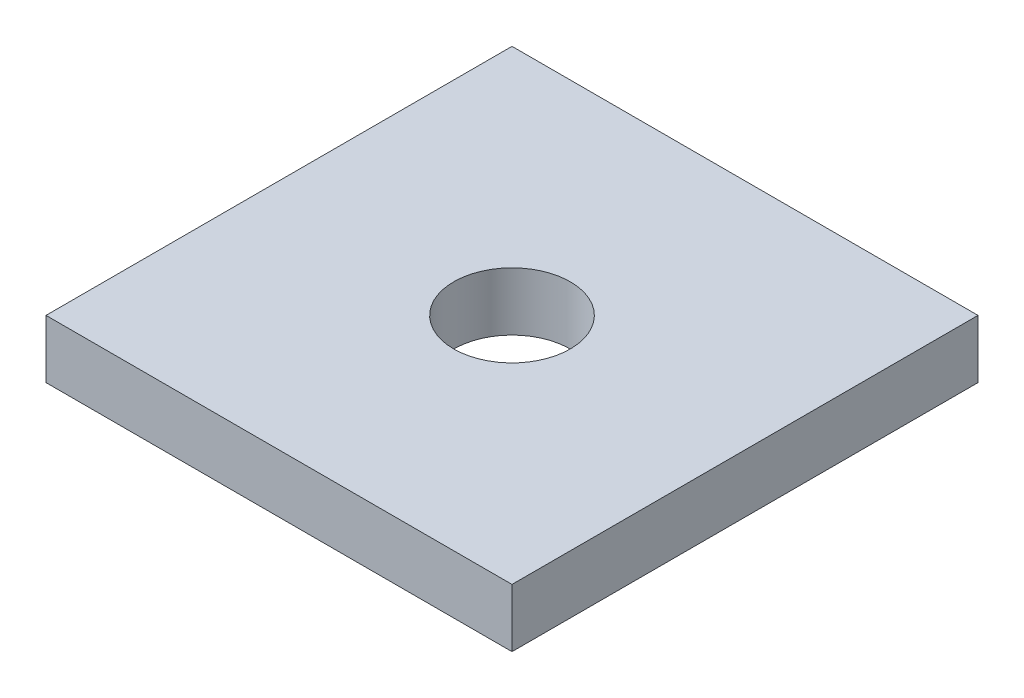
ISO-10303-21;
HEADER;
FILE_DESCRIPTION(('STEP AP214'),'2;1');
FILE_NAME('part.step','',(''),(''),'','','');
FILE_SCHEMA(('AUTOMOTIVE_DESIGN { 1 0 10303 214 1 1 1 1 }'));
ENDSEC;
DATA;
#1=APPLICATION_CONTEXT('core data for automotive mechanical design processes');
#2=APPLICATION_PROTOCOL_DEFINITION('international standard','automotive_design',2000,#1);
#3=PRODUCT_CONTEXT('',#1,'mechanical');
#4=PRODUCT('Part','Part','',(#3));
#5=PRODUCT_RELATED_PRODUCT_CATEGORY('part','',(#4));
#6=PRODUCT_DEFINITION_FORMATION('','',#4);
#7=PRODUCT_DEFINITION_CONTEXT('part definition',#1,'design');
#8=PRODUCT_DEFINITION('design','',#6,#7);
#9=PRODUCT_DEFINITION_SHAPE('','',#8);
#10=(LENGTH_UNIT() NAMED_UNIT(*) SI_UNIT(.MILLI.,.METRE.));
#11=(NAMED_UNIT(*) PLANE_ANGLE_UNIT() SI_UNIT($,.RADIAN.));
#12=(NAMED_UNIT(*) SI_UNIT($,.STERADIAN.) SOLID_ANGLE_UNIT());
#13=UNCERTAINTY_MEASURE_WITH_UNIT(LENGTH_MEASURE(1.E-05),#10,'distance_accuracy_value','');
#14=(GEOMETRIC_REPRESENTATION_CONTEXT(3) GLOBAL_UNCERTAINTY_ASSIGNED_CONTEXT((#13)) GLOBAL_UNIT_ASSIGNED_CONTEXT((#10,
#11,#12)) REPRESENTATION_CONTEXT('',''));
#15=CARTESIAN_POINT('',(0.,0.,0.));
#16=DIRECTION('',(0.,0.,1.));
#17=DIRECTION('',(1.,0.,0.));
#18=AXIS2_PLACEMENT_3D('',#15,#16,#17);
#19=CARTESIAN_POINT('',(0.,9.525,-76.2));
#20=DIRECTION('',(0.,-1.,0.));
#21=DIRECTION('',(0.,0.,-1.));
#22=AXIS2_PLACEMENT_3D('',#19,#20,#21);
#23=PLANE('',#22);
#24=DIRECTION('',(0.,0.,1.));
#25=VECTOR('',#24,1.);
#26=CARTESIAN_POINT('',(0.,9.525,0.));
#27=LINE('',#26,#25);
#28=CARTESIAN_POINT('',(0.,9.525,-76.2));
#29=VERTEX_POINT('',#28);
#30=CARTESIAN_POINT('',(0.,9.525,0.));
#31=VERTEX_POINT('',#30);
#32=EDGE_CURVE('E86',#29,#31,#27,.T.);
#33=ORIENTED_EDGE('',*,*,#32,.T.);
#34=DIRECTION('',(1.,0.,0.));
#35=VECTOR('',#34,1.);
#36=CARTESIAN_POINT('',(0.,9.525,0.));
#37=LINE('',#36,#35);
#38=CARTESIAN_POINT('',(76.2,9.525,0.));
#39=VERTEX_POINT('',#38);
#40=EDGE_CURVE('E81',#31,#39,#37,.T.);
#41=ORIENTED_EDGE('',*,*,#40,.T.);
#42=DIRECTION('',(0.,0.,-1.));
#43=VECTOR('',#42,1.);
#44=CARTESIAN_POINT('',(76.2,9.525,0.));
#45=LINE('',#44,#43);
#46=CARTESIAN_POINT('',(76.2,9.525,-76.2));
#47=VERTEX_POINT('',#46);
#48=EDGE_CURVE('E84',#39,#47,#45,.T.);
#49=ORIENTED_EDGE('',*,*,#48,.T.);
#50=DIRECTION('',(-1.,0.,0.));
#51=VECTOR('',#50,1.);
#52=CARTESIAN_POINT('',(0.,9.525,-76.2));
#53=LINE('',#52,#51);
#54=EDGE_CURVE('E51',#47,#29,#53,.T.);
#55=ORIENTED_EDGE('',*,*,#54,.T.);
#56=EDGE_LOOP('',(#33,#41,#49,#55));
#57=FACE_BOUND('',#56,.T.);
#58=CARTESIAN_POINT('',(38.1,9.525,-38.1));
#59=DIRECTION('',(0.,1.,0.));
#60=DIRECTION('',(0.,0.,1.));
#61=AXIS2_PLACEMENT_3D('',#58,#59,#60);
#62=CIRCLE('',#61,9.525);
#63=CARTESIAN_POINT('',(38.1,9.525,-28.575));
#64=VERTEX_POINT('',#63);
#65=EDGE_CURVE('E101',#64,#64,#62,.T.);
#66=ORIENTED_EDGE('',*,*,#65,.F.);
#67=EDGE_LOOP('',(#66));
#68=FACE_BOUND('',#67,.T.);
#69=ADVANCED_FACE('F34',(#57,#68),#23,.F.);
#70=CARTESIAN_POINT('',(0.,0.,-76.2));
#71=DIRECTION('',(0.,-1.,0.));
#72=DIRECTION('',(0.,0.,-1.));
#73=AXIS2_PLACEMENT_3D('',#70,#71,#72);
#74=PLANE('',#73);
#75=DIRECTION('',(0.,0.,1.));
#76=VECTOR('',#75,1.);
#77=CARTESIAN_POINT('',(0.,0.,0.));
#78=LINE('',#77,#76);
#79=CARTESIAN_POINT('',(0.,0.,-76.2));
#80=VERTEX_POINT('',#79);
#81=CARTESIAN_POINT('',(0.,0.,0.));
#82=VERTEX_POINT('',#81);
#83=EDGE_CURVE('E98',#80,#82,#78,.T.);
#84=ORIENTED_EDGE('',*,*,#83,.F.);
#85=DIRECTION('',(-1.,0.,0.));
#86=VECTOR('',#85,1.);
#87=CARTESIAN_POINT('',(0.,0.,-76.2));
#88=LINE('',#87,#86);
#89=CARTESIAN_POINT('',(76.2,0.,-76.2));
#90=VERTEX_POINT('',#89);
#91=EDGE_CURVE('E74',#90,#80,#88,.T.);
#92=ORIENTED_EDGE('',*,*,#91,.F.);
#93=DIRECTION('',(0.,0.,-1.));
#94=VECTOR('',#93,1.);
#95=CARTESIAN_POINT('',(76.2,0.,0.));
#96=LINE('',#95,#94);
#97=CARTESIAN_POINT('',(76.2,0.,0.));
#98=VERTEX_POINT('',#97);
#99=EDGE_CURVE('E68',#98,#90,#96,.T.);
#100=ORIENTED_EDGE('',*,*,#99,.F.);
#101=DIRECTION('',(1.,0.,0.));
#102=VECTOR('',#101,1.);
#103=CARTESIAN_POINT('',(0.,0.,0.));
#104=LINE('',#103,#102);
#105=EDGE_CURVE('E90',#82,#98,#104,.T.);
#106=ORIENTED_EDGE('',*,*,#105,.F.);
#107=EDGE_LOOP('',(#84,#92,#100,#106));
#108=FACE_BOUND('',#107,.T.);
#109=CARTESIAN_POINT('',(38.1,0.,-38.1));
#110=DIRECTION('',(0.,1.,0.));
#111=DIRECTION('',(0.,0.,1.));
#112=AXIS2_PLACEMENT_3D('',#109,#110,#111);
#113=CIRCLE('',#112,9.525);
#114=CARTESIAN_POINT('',(38.1,0.,-28.575));
#115=VERTEX_POINT('',#114);
#116=EDGE_CURVE('E113',#115,#115,#113,.T.);
#117=ORIENTED_EDGE('',*,*,#116,.T.);
#118=EDGE_LOOP('',(#117));
#119=FACE_BOUND('',#118,.T.);
#120=ADVANCED_FACE('F109',(#108,#119),#74,.T.);
#121=CARTESIAN_POINT('',(0.,9.525,0.));
#122=DIRECTION('',(1.,0.,0.));
#123=DIRECTION('',(0.,0.,-1.));
#124=AXIS2_PLACEMENT_3D('',#121,#122,#123);
#125=PLANE('',#124);
#126=ORIENTED_EDGE('',*,*,#83,.T.);
#127=DIRECTION('',(0.,-1.,0.));
#128=VECTOR('',#127,1.);
#129=CARTESIAN_POINT('',(0.,9.525,0.));
#130=LINE('',#129,#128);
#131=EDGE_CURVE('E11',#31,#82,#130,.T.);
#132=ORIENTED_EDGE('',*,*,#131,.F.);
#133=ORIENTED_EDGE('',*,*,#32,.F.);
#134=DIRECTION('',(0.,-1.,0.));
#135=VECTOR('',#134,1.);
#136=CARTESIAN_POINT('',(0.,9.525,-76.2));
#137=LINE('',#136,#135);
#138=EDGE_CURVE('E94',#29,#80,#137,.T.);
#139=ORIENTED_EDGE('',*,*,#138,.T.);
#140=EDGE_LOOP('',(#126,#132,#133,#139));
#141=FACE_BOUND('',#140,.T.);
#142=ADVANCED_FACE('F36',(#141),#125,.F.);
#143=CARTESIAN_POINT('',(0.,9.525,0.));
#144=DIRECTION('',(0.,0.,-1.));
#145=DIRECTION('',(-1.,0.,0.));
#146=AXIS2_PLACEMENT_3D('',#143,#144,#145);
#147=PLANE('',#146);
#148=ORIENTED_EDGE('',*,*,#105,.T.);
#149=DIRECTION('',(0.,-1.,0.));
#150=VECTOR('',#149,1.);
#151=CARTESIAN_POINT('',(76.2,9.525,0.));
#152=LINE('',#151,#150);
#153=EDGE_CURVE('E43',#39,#98,#152,.T.);
#154=ORIENTED_EDGE('',*,*,#153,.F.);
#155=ORIENTED_EDGE('',*,*,#40,.F.);
#156=ORIENTED_EDGE('',*,*,#131,.T.);
#157=EDGE_LOOP('',(#148,#154,#155,#156));
#158=FACE_BOUND('',#157,.T.);
#159=ADVANCED_FACE('F89',(#158),#147,.F.);
#160=CARTESIAN_POINT('',(76.2,9.525,0.));
#161=DIRECTION('',(-1.,0.,0.));
#162=DIRECTION('',(0.,0.,1.));
#163=AXIS2_PLACEMENT_3D('',#160,#161,#162);
#164=PLANE('',#163);
#165=ORIENTED_EDGE('',*,*,#99,.T.);
#166=DIRECTION('',(0.,-1.,0.));
#167=VECTOR('',#166,1.);
#168=CARTESIAN_POINT('',(76.2,9.525,-76.2));
#169=LINE('',#168,#167);
#170=EDGE_CURVE('E91',#47,#90,#169,.T.);
#171=ORIENTED_EDGE('',*,*,#170,.F.);
#172=ORIENTED_EDGE('',*,*,#48,.F.);
#173=ORIENTED_EDGE('',*,*,#153,.T.);
#174=EDGE_LOOP('',(#165,#171,#172,#173));
#175=FACE_BOUND('',#174,.T.);
#176=ADVANCED_FACE('F92',(#175),#164,.F.);
#177=CARTESIAN_POINT('',(0.,9.525,-76.2));
#178=DIRECTION('',(0.,0.,1.));
#179=DIRECTION('',(1.,0.,0.));
#180=AXIS2_PLACEMENT_3D('',#177,#178,#179);
#181=PLANE('',#180);
#182=ORIENTED_EDGE('',*,*,#91,.T.);
#183=ORIENTED_EDGE('',*,*,#138,.F.);
#184=ORIENTED_EDGE('',*,*,#54,.F.);
#185=ORIENTED_EDGE('',*,*,#170,.T.);
#186=EDGE_LOOP('',(#182,#183,#184,#185));
#187=FACE_BOUND('',#186,.T.);
#188=ADVANCED_FACE('F106',(#187),#181,.F.);
#189=CARTESIAN_POINT('',(38.1,9.525,-38.1));
#190=DIRECTION('',(0.,-1.,0.));
#191=DIRECTION('',(0.,0.,-1.));
#192=AXIS2_PLACEMENT_3D('',#189,#190,#191);
#193=CYLINDRICAL_SURFACE('',#192,9.525);
#194=ORIENTED_EDGE('',*,*,#65,.T.);
#195=EDGE_LOOP('',(#194));
#196=FACE_BOUND('',#195,.T.);
#197=ORIENTED_EDGE('',*,*,#116,.F.);
#198=EDGE_LOOP('',(#197));
#199=FACE_BOUND('',#198,.T.);
#200=ADVANCED_FACE('F119',(#196,#199),#193,.F.);
#201=CLOSED_SHELL('',(#69,#120,#142,#159,#176,#188,#200));
#202=MANIFOLD_SOLID_BREP('B2',#201);
#203=ADVANCED_BREP_SHAPE_REPRESENTATION('',(#18,#202),#14);
#204=SHAPE_DEFINITION_REPRESENTATION(#9,#203);
ENDSEC;
END-ISO-10303-21;
